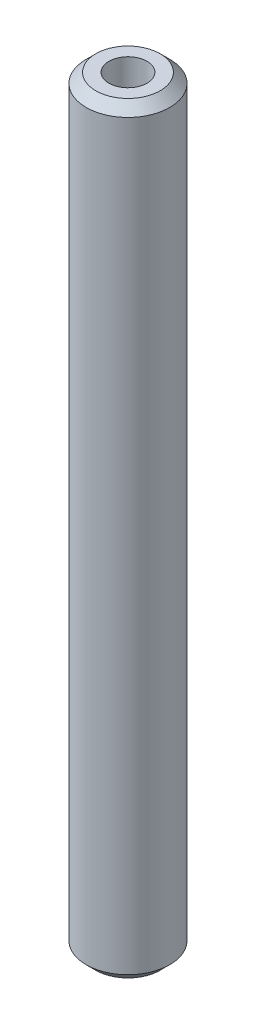
ISO-10303-21;
HEADER;
FILE_DESCRIPTION(('STEP AP214'),'2;1');
FILE_NAME('part.step','',(''),(''),'','','');
FILE_SCHEMA(('AUTOMOTIVE_DESIGN { 1 0 10303 214 1 1 1 1 }'));
ENDSEC;
DATA;
#1=APPLICATION_CONTEXT('core data for automotive mechanical design processes');
#2=APPLICATION_PROTOCOL_DEFINITION('international standard','automotive_design',2000,#1);
#3=PRODUCT_CONTEXT('',#1,'mechanical');
#4=PRODUCT('Part','Part','',(#3));
#5=PRODUCT_RELATED_PRODUCT_CATEGORY('part','',(#4));
#6=PRODUCT_DEFINITION_FORMATION('','',#4);
#7=PRODUCT_DEFINITION_CONTEXT('part definition',#1,'design');
#8=PRODUCT_DEFINITION('design','',#6,#7);
#9=PRODUCT_DEFINITION_SHAPE('','',#8);
#10=(LENGTH_UNIT() NAMED_UNIT(*) SI_UNIT(.MILLI.,.METRE.));
#11=(NAMED_UNIT(*) PLANE_ANGLE_UNIT() SI_UNIT($,.RADIAN.));
#12=(NAMED_UNIT(*) SI_UNIT($,.STERADIAN.) SOLID_ANGLE_UNIT());
#13=UNCERTAINTY_MEASURE_WITH_UNIT(LENGTH_MEASURE(1.E-05),#10,'distance_accuracy_value','');
#14=(GEOMETRIC_REPRESENTATION_CONTEXT(3) GLOBAL_UNCERTAINTY_ASSIGNED_CONTEXT((#13)) GLOBAL_UNIT_ASSIGNED_CONTEXT((#10,
#11,#12)) REPRESENTATION_CONTEXT('',''));
#15=CARTESIAN_POINT('',(0.,0.,0.));
#16=DIRECTION('',(0.,0.,1.));
#17=DIRECTION('',(1.,0.,0.));
#18=AXIS2_PLACEMENT_3D('',#15,#16,#17);
#19=CARTESIAN_POINT('',(0.,182.311949770164,0.));
#20=DIRECTION('',(0.,-1.,0.));
#21=DIRECTION('',(0.,0.,-1.));
#22=AXIS2_PLACEMENT_3D('',#19,#20,#21);
#23=CYLINDRICAL_SURFACE('',#22,10.);
#24=CARTESIAN_POINT('',(0.,180.004135403608,0.));
#25=DIRECTION('',(0.,1.,0.));
#26=DIRECTION('',(0.,0.,1.));
#27=AXIS2_PLACEMENT_3D('',#24,#25,#26);
#28=CIRCLE('',#27,10.);
#29=CARTESIAN_POINT('',(0.,180.004135403608,10.));
#30=VERTEX_POINT('',#29);
#31=EDGE_CURVE('E50',#30,#30,#28,.F.);
#32=ORIENTED_EDGE('',*,*,#31,.T.);
#33=EDGE_LOOP('',(#32));
#34=FACE_BOUND('',#33,.T.);
#35=CARTESIAN_POINT('',(0.,2.30781436655655,0.));
#36=DIRECTION('',(0.,1.,0.));
#37=DIRECTION('',(0.,0.,1.));
#38=AXIS2_PLACEMENT_3D('',#35,#36,#37);
#39=CIRCLE('',#38,10.);
#40=CARTESIAN_POINT('',(0.,2.30781436655655,10.));
#41=VERTEX_POINT('',#40);
#42=EDGE_CURVE('E51',#41,#41,#39,.T.);
#43=ORIENTED_EDGE('',*,*,#42,.T.);
#44=EDGE_LOOP('',(#43));
#45=FACE_BOUND('',#44,.T.);
#46=ADVANCED_FACE('F39',(#34,#45),#23,.T.);
#47=CARTESIAN_POINT('',(0.,182.311949770164,0.));
#48=DIRECTION('',(0.,1.,0.));
#49=DIRECTION('',(0.,0.,1.));
#50=AXIS2_PLACEMENT_3D('',#47,#48,#49);
#51=PLANE('',#50);
#52=CARTESIAN_POINT('',(0.,182.311949770164,0.));
#53=DIRECTION('',(0.,1.,0.));
#54=DIRECTION('',(0.,0.,1.));
#55=AXIS2_PLACEMENT_3D('',#52,#53,#54);
#56=CIRCLE('',#55,7.6921856334434);
#57=CARTESIAN_POINT('',(0.,182.311949770164,7.6921856334434));
#58=VERTEX_POINT('',#57);
#59=EDGE_CURVE('E54',#58,#58,#56,.T.);
#60=ORIENTED_EDGE('',*,*,#59,.T.);
#61=EDGE_LOOP('',(#60));
#62=FACE_BOUND('',#61,.T.);
#63=CARTESIAN_POINT('',(0.,182.311949770164,0.));
#64=DIRECTION('',(0.,1.,0.));
#65=DIRECTION('',(0.,0.,1.));
#66=AXIS2_PLACEMENT_3D('',#63,#64,#65);
#67=CIRCLE('',#66,4.5571362436026);
#68=CARTESIAN_POINT('',(0.,182.311949770164,4.5571362436026));
#69=VERTEX_POINT('',#68);
#70=EDGE_CURVE('E58',#69,#69,#67,.T.);
#71=ORIENTED_EDGE('',*,*,#70,.F.);
#72=EDGE_LOOP('',(#71));
#73=FACE_BOUND('',#72,.T.);
#74=ADVANCED_FACE('F69',(#62,#73),#51,.T.);
#75=CARTESIAN_POINT('',(0.,0.,0.));
#76=DIRECTION('',(0.,1.,0.));
#77=DIRECTION('',(0.,0.,1.));
#78=AXIS2_PLACEMENT_3D('',#75,#76,#77);
#79=PLANE('',#78);
#80=CARTESIAN_POINT('',(0.,0.,0.));
#81=DIRECTION('',(0.,1.,0.));
#82=DIRECTION('',(0.,0.,1.));
#83=AXIS2_PLACEMENT_3D('',#80,#81,#82);
#84=CIRCLE('',#83,7.69218563344341);
#85=CARTESIAN_POINT('',(0.,0.,7.69218563344341));
#86=VERTEX_POINT('',#85);
#87=EDGE_CURVE('E10',#86,#86,#84,.F.);
#88=ORIENTED_EDGE('',*,*,#87,.T.);
#89=EDGE_LOOP('',(#88));
#90=FACE_BOUND('',#89,.T.);
#91=CARTESIAN_POINT('',(0.,0.,0.));
#92=DIRECTION('',(0.,1.,0.));
#93=DIRECTION('',(0.,0.,1.));
#94=AXIS2_PLACEMENT_3D('',#91,#92,#93);
#95=CIRCLE('',#94,4.5571362436026);
#96=CARTESIAN_POINT('',(0.,0.,4.5571362436026));
#97=VERTEX_POINT('',#96);
#98=EDGE_CURVE('E63',#97,#97,#95,.T.);
#99=ORIENTED_EDGE('',*,*,#98,.T.);
#100=EDGE_LOOP('',(#99));
#101=FACE_BOUND('',#100,.T.);
#102=ADVANCED_FACE('F75',(#90,#101),#79,.F.);
#103=CARTESIAN_POINT('',(0.,182.311949770164,0.));
#104=DIRECTION('',(0.,-1.,0.));
#105=DIRECTION('',(0.,0.,-1.));
#106=AXIS2_PLACEMENT_3D('',#103,#104,#105);
#107=CYLINDRICAL_SURFACE('',#106,4.5571362436026);
#108=ORIENTED_EDGE('',*,*,#70,.T.);
#109=EDGE_LOOP('',(#108));
#110=FACE_BOUND('',#109,.T.);
#111=ORIENTED_EDGE('',*,*,#98,.F.);
#112=EDGE_LOOP('',(#111));
#113=FACE_BOUND('',#112,.T.);
#114=ADVANCED_FACE('F70',(#110,#113),#107,.F.);
#115=CARTESIAN_POINT('',(0.,182.311949770164,0.));
#116=DIRECTION('',(0.,-1.,0.));
#117=DIRECTION('',(0.,0.,-1.));
#118=AXIS2_PLACEMENT_3D('',#115,#116,#117);
#119=CONICAL_SURFACE('',#118,7.6921856334434,0.785398163397446);
#120=ORIENTED_EDGE('',*,*,#31,.F.);
#121=EDGE_LOOP('',(#120));
#122=FACE_BOUND('',#121,.T.);
#123=ORIENTED_EDGE('',*,*,#59,.F.);
#124=EDGE_LOOP('',(#123));
#125=FACE_BOUND('',#124,.T.);
#126=ADVANCED_FACE('F81',(#122,#125),#119,.T.);
#127=CARTESIAN_POINT('',(0.,2.30781436655655,0.));
#128=DIRECTION('',(0.,1.,0.));
#129=DIRECTION('',(0.,0.,1.));
#130=AXIS2_PLACEMENT_3D('',#127,#128,#129);
#131=CONICAL_SURFACE('',#130,10.,0.785398163397455);
#132=ORIENTED_EDGE('',*,*,#87,.F.);
#133=EDGE_LOOP('',(#132));
#134=FACE_BOUND('',#133,.T.);
#135=ORIENTED_EDGE('',*,*,#42,.F.);
#136=EDGE_LOOP('',(#135));
#137=FACE_BOUND('',#136,.T.);
#138=ADVANCED_FACE('F45',(#134,#137),#131,.T.);
#139=CLOSED_SHELL('',(#46,#74,#102,#114,#126,#138));
#140=MANIFOLD_SOLID_BREP('B2',#139);
#141=ADVANCED_BREP_SHAPE_REPRESENTATION('',(#18,#140),#14);
#142=SHAPE_DEFINITION_REPRESENTATION(#9,#141);
ENDSEC;
END-ISO-10303-21;
